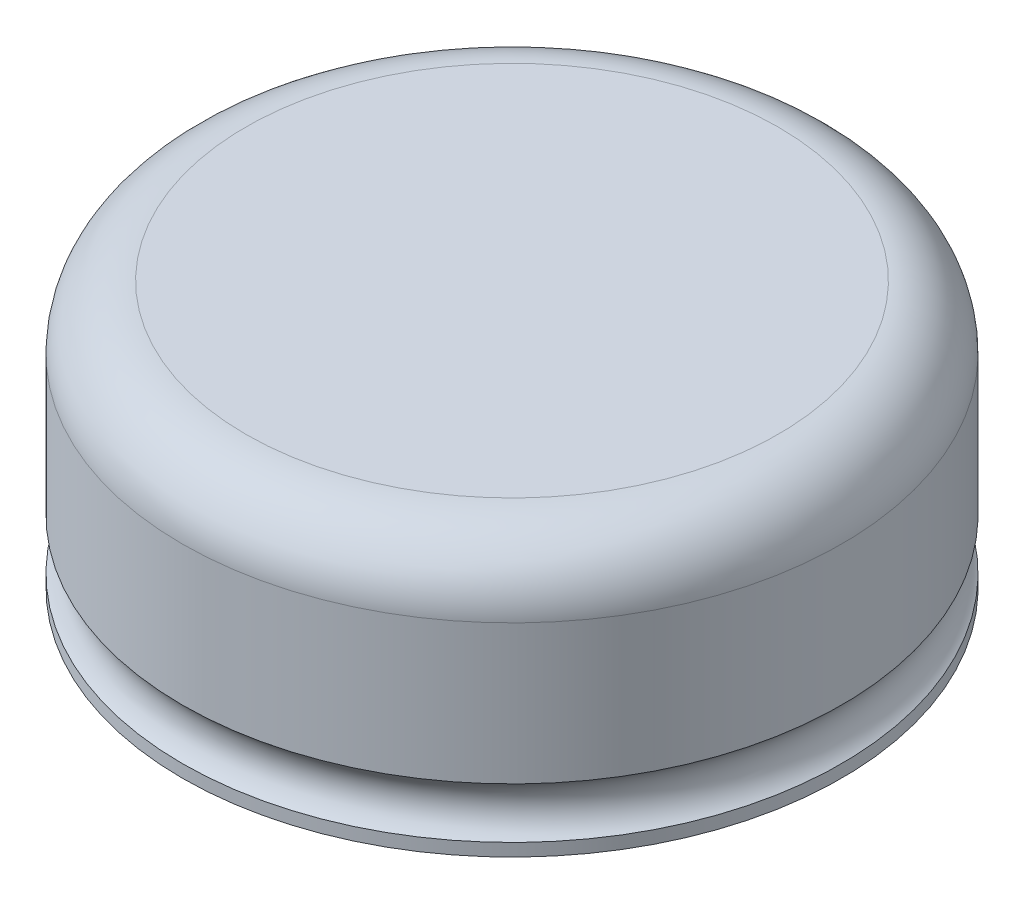
ISO-10303-21;
HEADER;
FILE_DESCRIPTION(('STEP AP214'),'2;1');
FILE_NAME('part.step','',(''),(''),'','','');
FILE_SCHEMA(('AUTOMOTIVE_DESIGN { 1 0 10303 214 1 1 1 1 }'));
ENDSEC;
DATA;
#1=APPLICATION_CONTEXT('core data for automotive mechanical design processes');
#2=APPLICATION_PROTOCOL_DEFINITION('international standard','automotive_design',2000,#1);
#3=PRODUCT_CONTEXT('',#1,'mechanical');
#4=PRODUCT('Part','Part','',(#3));
#5=PRODUCT_RELATED_PRODUCT_CATEGORY('part','',(#4));
#6=PRODUCT_DEFINITION_FORMATION('','',#4);
#7=PRODUCT_DEFINITION_CONTEXT('part definition',#1,'design');
#8=PRODUCT_DEFINITION('design','',#6,#7);
#9=PRODUCT_DEFINITION_SHAPE('','',#8);
#10=(LENGTH_UNIT() NAMED_UNIT(*) SI_UNIT(.MILLI.,.METRE.));
#11=(NAMED_UNIT(*) PLANE_ANGLE_UNIT() SI_UNIT($,.RADIAN.));
#12=(NAMED_UNIT(*) SI_UNIT($,.STERADIAN.) SOLID_ANGLE_UNIT());
#13=UNCERTAINTY_MEASURE_WITH_UNIT(LENGTH_MEASURE(1.E-05),#10,'distance_accuracy_value','');
#14=(GEOMETRIC_REPRESENTATION_CONTEXT(3) GLOBAL_UNCERTAINTY_ASSIGNED_CONTEXT((#13)) GLOBAL_UNIT_ASSIGNED_CONTEXT((#10,
#11,#12)) REPRESENTATION_CONTEXT('',''));
#15=CARTESIAN_POINT('',(0.,0.,0.));
#16=DIRECTION('',(0.,0.,1.));
#17=DIRECTION('',(1.,0.,0.));
#18=AXIS2_PLACEMENT_3D('',#15,#16,#17);
#19=CARTESIAN_POINT('',(0.,0.,0.));
#20=DIRECTION('',(0.,1.,0.));
#21=DIRECTION('',(0.,0.,1.));
#22=AXIS2_PLACEMENT_3D('',#19,#20,#21);
#23=CYLINDRICAL_SURFACE('',#22,26.);
#24=CARTESIAN_POINT('',(0.,1.,0.));
#25=DIRECTION('',(0.,1.,0.));
#26=DIRECTION('',(0.,0.,1.));
#27=AXIS2_PLACEMENT_3D('',#24,#25,#26);
#28=CIRCLE('',#27,26.);
#29=CARTESIAN_POINT('',(0.,1.,26.));
#30=VERTEX_POINT('',#29);
#31=EDGE_CURVE('E44',#30,#30,#28,.T.);
#32=ORIENTED_EDGE('',*,*,#31,.F.);
#33=EDGE_LOOP('',(#32));
#34=FACE_BOUND('',#33,.T.);
#35=CARTESIAN_POINT('',(0.,0.,0.));
#36=DIRECTION('',(0.,1.,0.));
#37=DIRECTION('',(0.,0.,1.));
#38=AXIS2_PLACEMENT_3D('',#35,#36,#37);
#39=CIRCLE('',#38,26.);
#40=CARTESIAN_POINT('',(0.,0.,26.));
#41=VERTEX_POINT('',#40);
#42=EDGE_CURVE('E53',#41,#41,#39,.T.);
#43=ORIENTED_EDGE('',*,*,#42,.T.);
#44=EDGE_LOOP('',(#43));
#45=FACE_BOUND('',#44,.T.);
#46=ADVANCED_FACE('F33',(#34,#45),#23,.T.);
#47=CARTESIAN_POINT('',(0.,3.,0.));
#48=DIRECTION('',(0.,1.,0.));
#49=DIRECTION('',(0.,0.,1.));
#50=AXIS2_PLACEMENT_3D('',#47,#48,#49);
#51=TOROIDAL_SURFACE('',#50,27.5,2.5);
#52=CARTESIAN_POINT('',(0.,5.,0.));
#53=DIRECTION('',(0.,1.,0.));
#54=DIRECTION('',(0.,0.,1.));
#55=AXIS2_PLACEMENT_3D('',#52,#53,#54);
#56=CIRCLE('',#55,26.);
#57=CARTESIAN_POINT('',(0.,5.,26.));
#58=VERTEX_POINT('',#57);
#59=EDGE_CURVE('E48',#58,#58,#56,.T.);
#60=ORIENTED_EDGE('',*,*,#59,.F.);
#61=EDGE_LOOP('',(#60));
#62=FACE_BOUND('',#61,.T.);
#63=ORIENTED_EDGE('',*,*,#31,.T.);
#64=EDGE_LOOP('',(#63));
#65=FACE_BOUND('',#64,.T.);
#66=ADVANCED_FACE('F68',(#62,#65),#51,.F.);
#67=CARTESIAN_POINT('',(0.,0.,0.));
#68=DIRECTION('',(0.,1.,0.));
#69=DIRECTION('',(0.,0.,1.));
#70=AXIS2_PLACEMENT_3D('',#67,#68,#69);
#71=CYLINDRICAL_SURFACE('',#70,26.);
#72=CARTESIAN_POINT('',(0.,16.,0.));
#73=DIRECTION('',(0.,1.,0.));
#74=DIRECTION('',(0.,0.,1.));
#75=AXIS2_PLACEMENT_3D('',#72,#73,#74);
#76=CIRCLE('',#75,26.);
#77=CARTESIAN_POINT('',(0.,16.,26.));
#78=VERTEX_POINT('',#77);
#79=EDGE_CURVE('E10',#78,#78,#76,.F.);
#80=ORIENTED_EDGE('',*,*,#79,.T.);
#81=EDGE_LOOP('',(#80));
#82=FACE_BOUND('',#81,.T.);
#83=ORIENTED_EDGE('',*,*,#59,.T.);
#84=EDGE_LOOP('',(#83));
#85=FACE_BOUND('',#84,.T.);
#86=ADVANCED_FACE('F61',(#82,#85),#71,.T.);
#87=CARTESIAN_POINT('',(0.,0.,0.));
#88=DIRECTION('',(0.,1.,0.));
#89=DIRECTION('',(0.,0.,1.));
#90=AXIS2_PLACEMENT_3D('',#87,#88,#89);
#91=PLANE('',#90);
#92=ORIENTED_EDGE('',*,*,#42,.F.);
#93=EDGE_LOOP('',(#92));
#94=FACE_BOUND('',#93,.T.);
#95=ADVANCED_FACE('F58',(#94),#91,.F.);
#96=CARTESIAN_POINT('',(0.,21.,0.));
#97=DIRECTION('',(0.,1.,0.));
#98=DIRECTION('',(0.,0.,1.));
#99=AXIS2_PLACEMENT_3D('',#96,#97,#98);
#100=PLANE('',#99);
#101=CARTESIAN_POINT('',(0.,21.,0.));
#102=DIRECTION('',(0.,1.,0.));
#103=DIRECTION('',(0.,0.,1.));
#104=AXIS2_PLACEMENT_3D('',#101,#102,#103);
#105=CIRCLE('',#104,21.);
#106=CARTESIAN_POINT('',(0.,21.,21.));
#107=VERTEX_POINT('',#106);
#108=EDGE_CURVE('E40',#107,#107,#105,.T.);
#109=ORIENTED_EDGE('',*,*,#108,.T.);
#110=EDGE_LOOP('',(#109));
#111=FACE_BOUND('',#110,.T.);
#112=ADVANCED_FACE('F60',(#111),#100,.T.);
#113=CARTESIAN_POINT('',(0.,16.,0.));
#114=DIRECTION('',(0.,1.,0.));
#115=DIRECTION('',(0.,0.,1.));
#116=AXIS2_PLACEMENT_3D('',#113,#114,#115);
#117=TOROIDAL_SURFACE('',#116,21.,5.);
#118=ORIENTED_EDGE('',*,*,#79,.F.);
#119=EDGE_LOOP('',(#118));
#120=FACE_BOUND('',#119,.T.);
#121=ORIENTED_EDGE('',*,*,#108,.F.);
#122=EDGE_LOOP('',(#121));
#123=FACE_BOUND('',#122,.T.);
#124=ADVANCED_FACE('F35',(#120,#123),#117,.T.);
#125=CLOSED_SHELL('',(#46,#66,#86,#95,#112,#124));
#126=MANIFOLD_SOLID_BREP('B2',#125);
#127=ADVANCED_BREP_SHAPE_REPRESENTATION('',(#18,#126),#14);
#128=SHAPE_DEFINITION_REPRESENTATION(#9,#127);
ENDSEC;
END-ISO-10303-21;
